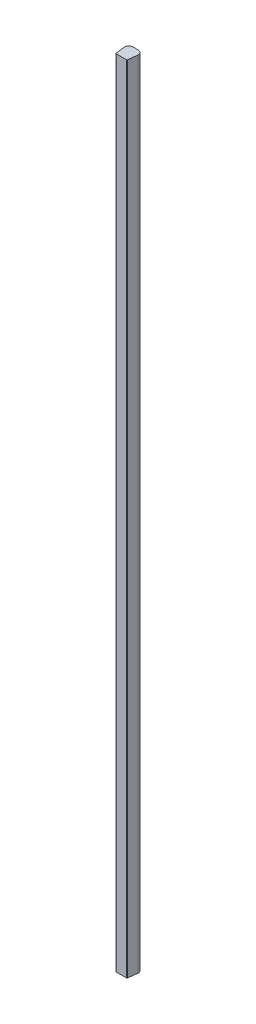
ISO-10303-21;
HEADER;
FILE_DESCRIPTION(('STEP AP214'),'2;1');
FILE_NAME('part.step','',(''),(''),'','','');
FILE_SCHEMA(('AUTOMOTIVE_DESIGN { 1 0 10303 214 1 1 1 1 }'));
ENDSEC;
DATA;
#1=APPLICATION_CONTEXT('core data for automotive mechanical design processes');
#2=APPLICATION_PROTOCOL_DEFINITION('international standard','automotive_design',2000,#1);
#3=PRODUCT_CONTEXT('',#1,'mechanical');
#4=PRODUCT('Part','Part','',(#3));
#5=PRODUCT_RELATED_PRODUCT_CATEGORY('part','',(#4));
#6=PRODUCT_DEFINITION_FORMATION('','',#4);
#7=PRODUCT_DEFINITION_CONTEXT('part definition',#1,'design');
#8=PRODUCT_DEFINITION('design','',#6,#7);
#9=PRODUCT_DEFINITION_SHAPE('','',#8);
#10=(LENGTH_UNIT() NAMED_UNIT(*) SI_UNIT(.MILLI.,.METRE.));
#11=(NAMED_UNIT(*) PLANE_ANGLE_UNIT() SI_UNIT($,.RADIAN.));
#12=(NAMED_UNIT(*) SI_UNIT($,.STERADIAN.) SOLID_ANGLE_UNIT());
#13=UNCERTAINTY_MEASURE_WITH_UNIT(LENGTH_MEASURE(1.E-05),#10,'distance_accuracy_value','');
#14=(GEOMETRIC_REPRESENTATION_CONTEXT(3) GLOBAL_UNCERTAINTY_ASSIGNED_CONTEXT((#13)) GLOBAL_UNIT_ASSIGNED_CONTEXT((#10,
#11,#12)) REPRESENTATION_CONTEXT('',''));
#15=CARTESIAN_POINT('',(0.,0.,0.));
#16=DIRECTION('',(0.,0.,1.));
#17=DIRECTION('',(1.,0.,0.));
#18=AXIS2_PLACEMENT_3D('',#15,#16,#17);
#19=CARTESIAN_POINT('',(12.657693959334,2133.6,2.96357615590343));
#20=DIRECTION('',(0.,-1.,0.));
#21=DIRECTION('',(0.,0.,-1.));
#22=AXIS2_PLACEMENT_3D('',#19,#20,#21);
#23=CYLINDRICAL_SURFACE('',#22,13.);
#24=CARTESIAN_POINT('',(12.657693959334,0.,2.96357615590343));
#25=DIRECTION('',(0.,1.,0.));
#26=DIRECTION('',(0.,0.,-1.));
#27=AXIS2_PLACEMENT_3D('',#24,#25,#26);
#28=CIRCLE('',#27,13.);
#29=CARTESIAN_POINT('',(13.6301615680965,0.,-10.));
#30=VERTEX_POINT('',#29);
#31=CARTESIAN_POINT('',(2.1101832656479,0.,-4.63576711615483));
#32=VERTEX_POINT('',#31);
#33=EDGE_CURVE('E152',#30,#32,#28,.T.);
#34=ORIENTED_EDGE('',*,*,#33,.T.);
#35=DIRECTION('',(0.,-1.,0.));
#36=VECTOR('',#35,1.);
#37=CARTESIAN_POINT('',(2.1101832656479,2133.6,-4.63576711615483));
#38=LINE('',#37,#36);
#39=CARTESIAN_POINT('',(2.1101832656479,2133.6,-4.63576711615483));
#40=VERTEX_POINT('',#39);
#41=EDGE_CURVE('E11',#40,#32,#38,.T.);
#42=ORIENTED_EDGE('',*,*,#41,.F.);
#43=CARTESIAN_POINT('',(12.657693959334,2133.6,2.96357615590343));
#44=DIRECTION('',(0.,1.,0.));
#45=DIRECTION('',(0.,0.,-1.));
#46=AXIS2_PLACEMENT_3D('',#43,#44,#45);
#47=CIRCLE('',#46,13.);
#48=CARTESIAN_POINT('',(13.6301615680965,2133.6,-10.));
#49=VERTEX_POINT('',#48);
#50=EDGE_CURVE('E180',#49,#40,#47,.T.);
#51=ORIENTED_EDGE('',*,*,#50,.F.);
#52=DIRECTION('',(0.,-1.,0.));
#53=VECTOR('',#52,1.);
#54=CARTESIAN_POINT('',(13.6301615680965,2133.6,-10.));
#55=LINE('',#54,#53);
#56=EDGE_CURVE('E148',#49,#30,#55,.T.);
#57=ORIENTED_EDGE('',*,*,#56,.T.);
#58=EDGE_LOOP('',(#34,#42,#51,#57));
#59=FACE_BOUND('',#58,.T.);
#60=ADVANCED_FACE('F39',(#59),#23,.T.);
#61=CARTESIAN_POINT('',(10.2236530300218,2133.6,1.20988155465921));
#62=DIRECTION('',(0.,-1.,0.));
#63=DIRECTION('',(0.,0.,-1.));
#64=AXIS2_PLACEMENT_3D('',#61,#62,#63);
#65=CYLINDRICAL_SURFACE('',#64,10.);
#66=CARTESIAN_POINT('',(10.2236530300218,0.,1.20988155465921));
#67=DIRECTION('',(0.,1.,0.));
#68=DIRECTION('',(0.,0.,-1.));
#69=AXIS2_PLACEMENT_3D('',#66,#67,#68);
#70=CIRCLE('',#69,10.);
#71=CARTESIAN_POINT('',(0.298191513608607,0.,2.42857498871066));
#72=VERTEX_POINT('',#71);
#73=EDGE_CURVE('E156',#32,#72,#70,.T.);
#74=ORIENTED_EDGE('',*,*,#73,.T.);
#75=DIRECTION('',(0.,-1.,0.));
#76=VECTOR('',#75,1.);
#77=CARTESIAN_POINT('',(0.298191513608607,2133.6,2.42857498871066));
#78=LINE('',#77,#76);
#79=CARTESIAN_POINT('',(0.298191513608607,2133.6,2.42857498871066));
#80=VERTEX_POINT('',#79);
#81=EDGE_CURVE('E48',#80,#72,#78,.T.);
#82=ORIENTED_EDGE('',*,*,#81,.F.);
#83=CARTESIAN_POINT('',(10.2236530300218,2133.6,1.20988155465921));
#84=DIRECTION('',(0.,1.,0.));
#85=DIRECTION('',(0.,0.,-1.));
#86=AXIS2_PLACEMENT_3D('',#83,#84,#85);
#87=CIRCLE('',#86,10.);
#88=EDGE_CURVE('E105',#40,#80,#87,.T.);
#89=ORIENTED_EDGE('',*,*,#88,.F.);
#90=ORIENTED_EDGE('',*,*,#41,.T.);
#91=EDGE_LOOP('',(#74,#82,#89,#90));
#92=FACE_BOUND('',#91,.T.);
#93=ADVANCED_FACE('F244',(#92),#65,.T.);
#94=CARTESIAN_POINT('',(0.298191513608607,2133.6,2.42857498871066));
#95=DIRECTION('',(0.992546151641322,0.,-0.121869343405144));
#96=DIRECTION('',(-0.121869343405144,0.,-0.992546151641323));
#97=AXIS2_PLACEMENT_3D('',#94,#95,#96);
#98=PLANE('',#97);
#99=DIRECTION('',(0.121869343405144,0.,0.992546151641322));
#100=VECTOR('',#99,1.);
#101=CARTESIAN_POINT('',(0.298191513608607,0.,2.42857498871066));
#102=LINE('',#101,#100);
#103=CARTESIAN_POINT('',(3.29922521014799,0.,26.8700330553532));
#104=VERTEX_POINT('',#103);
#105=EDGE_CURVE('E159',#72,#104,#102,.T.);
#106=ORIENTED_EDGE('',*,*,#105,.T.);
#107=DIRECTION('',(0.,-1.,0.));
#108=VECTOR('',#107,1.);
#109=CARTESIAN_POINT('',(3.29922521014799,2133.6,26.8700330553532));
#110=LINE('',#109,#108);
#111=CARTESIAN_POINT('',(3.29922521014799,2133.6,26.8700330553532));
#112=VERTEX_POINT('',#111);
#113=EDGE_CURVE('E199',#112,#104,#110,.T.);
#114=ORIENTED_EDGE('',*,*,#113,.F.);
#115=DIRECTION('',(0.121869343405144,0.,0.992546151641322));
#116=VECTOR('',#115,1.);
#117=CARTESIAN_POINT('',(0.298191513608607,2133.6,2.42857498871066));
#118=LINE('',#117,#116);
#119=EDGE_CURVE('E209',#80,#112,#118,.T.);
#120=ORIENTED_EDGE('',*,*,#119,.F.);
#121=ORIENTED_EDGE('',*,*,#81,.T.);
#122=EDGE_LOOP('',(#106,#114,#120,#121));
#123=FACE_BOUND('',#122,.T.);
#124=ADVANCED_FACE('F207',(#123),#98,.F.);
#125=CARTESIAN_POINT('',(5.28431751343064,2133.6,26.6262943685429));
#126=DIRECTION('',(0.,-1.,0.));
#127=DIRECTION('',(0.,0.,-1.));
#128=AXIS2_PLACEMENT_3D('',#125,#126,#127);
#129=CYLINDRICAL_SURFACE('',#128,2.);
#130=CARTESIAN_POINT('',(5.28431751343064,0.,26.6262943685429));
#131=DIRECTION('',(0.,1.,0.));
#132=DIRECTION('',(0.,0.,1.));
#133=AXIS2_PLACEMENT_3D('',#130,#131,#132);
#134=CIRCLE('',#133,2.);
#135=CARTESIAN_POINT('',(5.28431751343065,0.,28.6262943685429));
#136=VERTEX_POINT('',#135);
#137=EDGE_CURVE('E162',#104,#136,#134,.T.);
#138=ORIENTED_EDGE('',*,*,#137,.T.);
#139=DIRECTION('',(0.,-1.,0.));
#140=VECTOR('',#139,1.);
#141=CARTESIAN_POINT('',(5.28431751343065,2133.6,28.6262943685429));
#142=LINE('',#141,#140);
#143=CARTESIAN_POINT('',(5.28431751343065,2133.6,28.6262943685429));
#144=VERTEX_POINT('',#143);
#145=EDGE_CURVE('E195',#144,#136,#142,.T.);
#146=ORIENTED_EDGE('',*,*,#145,.F.);
#147=CARTESIAN_POINT('',(5.28431751343064,2133.6,26.6262943685429));
#148=DIRECTION('',(0.,1.,0.));
#149=DIRECTION('',(0.,0.,1.));
#150=AXIS2_PLACEMENT_3D('',#147,#148,#149);
#151=CIRCLE('',#150,2.);
#152=EDGE_CURVE('E228',#112,#144,#151,.T.);
#153=ORIENTED_EDGE('',*,*,#152,.F.);
#154=ORIENTED_EDGE('',*,*,#113,.T.);
#155=EDGE_LOOP('',(#138,#146,#153,#154));
#156=FACE_BOUND('',#155,.T.);
#157=ADVANCED_FACE('F218',(#156),#129,.T.);
#158=CARTESIAN_POINT('',(5.28431751343065,2133.6,28.6262943685429));
#159=DIRECTION('',(0.,0.,-1.));
#160=DIRECTION('',(-1.,0.,0.));
#161=AXIS2_PLACEMENT_3D('',#158,#159,#160);
#162=PLANE('',#161);
#163=DIRECTION('',(1.,0.,0.));
#164=VECTOR('',#163,1.);
#165=CARTESIAN_POINT('',(5.28431751343065,0.,28.6262943685429));
#166=LINE('',#165,#164);
#167=CARTESIAN_POINT('',(31.9760056227623,0.,28.626294368543));
#168=VERTEX_POINT('',#167);
#169=EDGE_CURVE('E165',#136,#168,#166,.T.);
#170=ORIENTED_EDGE('',*,*,#169,.T.);
#171=DIRECTION('',(0.,-1.,0.));
#172=VECTOR('',#171,1.);
#173=CARTESIAN_POINT('',(31.9760056227623,2133.6,28.626294368543));
#174=LINE('',#173,#172);
#175=CARTESIAN_POINT('',(31.9760056227623,2133.6,28.626294368543));
#176=VERTEX_POINT('',#175);
#177=EDGE_CURVE('E191',#176,#168,#174,.T.);
#178=ORIENTED_EDGE('',*,*,#177,.F.);
#179=DIRECTION('',(1.,0.,0.));
#180=VECTOR('',#179,1.);
#181=CARTESIAN_POINT('',(5.28431751343065,2133.6,28.6262943685429));
#182=LINE('',#181,#180);
#183=EDGE_CURVE('E224',#144,#176,#182,.T.);
#184=ORIENTED_EDGE('',*,*,#183,.F.);
#185=ORIENTED_EDGE('',*,*,#145,.T.);
#186=EDGE_LOOP('',(#170,#178,#184,#185));
#187=FACE_BOUND('',#186,.T.);
#188=ADVANCED_FACE('F222',(#187),#162,.F.);
#189=CARTESIAN_POINT('',(31.9760056227623,2133.6,26.6262943685429));
#190=DIRECTION('',(0.,-1.,0.));
#191=DIRECTION('',(0.,0.,-1.));
#192=AXIS2_PLACEMENT_3D('',#189,#190,#191);
#193=CYLINDRICAL_SURFACE('',#192,2.);
#194=CARTESIAN_POINT('',(31.9760056227623,0.,26.6262943685429));
#195=DIRECTION('',(0.,1.,0.));
#196=DIRECTION('',(0.,0.,1.));
#197=AXIS2_PLACEMENT_3D('',#194,#195,#196);
#198=CIRCLE('',#197,2.);
#199=CARTESIAN_POINT('',(33.961097926045,0.,26.8700330553532));
#200=VERTEX_POINT('',#199);
#201=EDGE_CURVE('E168',#168,#200,#198,.T.);
#202=ORIENTED_EDGE('',*,*,#201,.T.);
#203=DIRECTION('',(0.,-1.,0.));
#204=VECTOR('',#203,1.);
#205=CARTESIAN_POINT('',(33.961097926045,2133.6,26.8700330553532));
#206=LINE('',#205,#204);
#207=CARTESIAN_POINT('',(33.961097926045,2133.6,26.8700330553532));
#208=VERTEX_POINT('',#207);
#209=EDGE_CURVE('E187',#208,#200,#206,.T.);
#210=ORIENTED_EDGE('',*,*,#209,.F.);
#211=CARTESIAN_POINT('',(31.9760056227623,2133.6,26.6262943685429));
#212=DIRECTION('',(0.,1.,0.));
#213=DIRECTION('',(0.,0.,1.));
#214=AXIS2_PLACEMENT_3D('',#211,#212,#213);
#215=CIRCLE('',#214,2.);
#216=EDGE_CURVE('E227',#176,#208,#215,.T.);
#217=ORIENTED_EDGE('',*,*,#216,.F.);
#218=ORIENTED_EDGE('',*,*,#177,.T.);
#219=EDGE_LOOP('',(#202,#210,#217,#218));
#220=FACE_BOUND('',#219,.T.);
#221=ADVANCED_FACE('F256',(#220),#193,.T.);
#222=CARTESIAN_POINT('',(36.970576623517,2133.6,2.35979597553153));
#223=DIRECTION('',(-0.992546151641322,0.,-0.121869343405151));
#224=DIRECTION('',(-0.121869343405151,0.,0.992546151641322));
#225=AXIS2_PLACEMENT_3D('',#222,#223,#224);
#226=PLANE('',#225);
#227=DIRECTION('',(0.121869343405151,0.,-0.992546151641322));
#228=VECTOR('',#227,1.);
#229=CARTESIAN_POINT('',(36.970576623517,0.,2.35979597553153));
#230=LINE('',#229,#228);
#231=CARTESIAN_POINT('',(36.970576623517,0.,2.35979597553153));
#232=VERTEX_POINT('',#231);
#233=EDGE_CURVE('E171',#200,#232,#230,.T.);
#234=ORIENTED_EDGE('',*,*,#233,.T.);
#235=DIRECTION('',(0.,-1.,0.));
#236=VECTOR('',#235,1.);
#237=CARTESIAN_POINT('',(36.970576623517,2133.6,2.35979597553153));
#238=LINE('',#237,#236);
#239=CARTESIAN_POINT('',(36.970576623517,2133.6,2.35979597553153));
#240=VERTEX_POINT('',#239);
#241=EDGE_CURVE('E141',#240,#232,#238,.T.);
#242=ORIENTED_EDGE('',*,*,#241,.F.);
#243=DIRECTION('',(0.121869343405151,0.,-0.992546151641322));
#244=VECTOR('',#243,1.);
#245=CARTESIAN_POINT('',(36.970576623517,2133.6,2.35979597553153));
#246=LINE('',#245,#244);
#247=EDGE_CURVE('E130',#208,#240,#246,.T.);
#248=ORIENTED_EDGE('',*,*,#247,.F.);
#249=ORIENTED_EDGE('',*,*,#209,.T.);
#250=EDGE_LOOP('',(#234,#242,#248,#249));
#251=FACE_BOUND('',#250,.T.);
#252=ADVANCED_FACE('F259',(#251),#226,.F.);
#253=CARTESIAN_POINT('',(27.0451151071038,2133.6,1.14110254148002));
#254=DIRECTION('',(0.,-1.,0.));
#255=DIRECTION('',(0.,0.,-1.));
#256=AXIS2_PLACEMENT_3D('',#253,#254,#255);
#257=CYLINDRICAL_SURFACE('',#256,10.);
#258=CARTESIAN_POINT('',(27.0451151071038,0.,1.14110254148002));
#259=DIRECTION('',(0.,1.,0.));
#260=DIRECTION('',(0.,0.,1.));
#261=AXIS2_PLACEMENT_3D('',#258,#259,#260);
#262=CIRCLE('',#261,10.);
#263=CARTESIAN_POINT('',(34.9994172411373,0.,-4.91934938560512));
#264=VERTEX_POINT('',#263);
#265=EDGE_CURVE('E139',#232,#264,#262,.T.);
#266=ORIENTED_EDGE('',*,*,#265,.T.);
#267=DIRECTION('',(0.,-1.,0.));
#268=VECTOR('',#267,1.);
#269=CARTESIAN_POINT('',(34.9994172411373,2133.6,-4.91934938560512));
#270=LINE('',#269,#268);
#271=CARTESIAN_POINT('',(34.9994172411373,2133.6,-4.91934938560512));
#272=VERTEX_POINT('',#271);
#273=EDGE_CURVE('E136',#272,#264,#270,.T.);
#274=ORIENTED_EDGE('',*,*,#273,.F.);
#275=CARTESIAN_POINT('',(27.0451151071038,2133.6,1.14110254148002));
#276=DIRECTION('',(0.,1.,0.));
#277=DIRECTION('',(0.,0.,1.));
#278=AXIS2_PLACEMENT_3D('',#275,#276,#277);
#279=CIRCLE('',#278,10.);
#280=EDGE_CURVE('E124',#240,#272,#279,.T.);
#281=ORIENTED_EDGE('',*,*,#280,.F.);
#282=ORIENTED_EDGE('',*,*,#241,.T.);
#283=EDGE_LOOP('',(#266,#274,#281,#282));
#284=FACE_BOUND('',#283,.T.);
#285=ADVANCED_FACE('F137',(#284),#257,.T.);
#286=CARTESIAN_POINT('',(24.6588244668938,2133.6,2.95923811960556));
#287=DIRECTION('',(0.,-1.,0.));
#288=DIRECTION('',(0.,0.,-1.));
#289=AXIS2_PLACEMENT_3D('',#286,#287,#288);
#290=CYLINDRICAL_SURFACE('',#289,13.);
#291=CARTESIAN_POINT('',(24.6588244668938,0.,2.95923811960556));
#292=DIRECTION('',(0.,1.,0.));
#293=DIRECTION('',(0.,0.,1.));
#294=AXIS2_PLACEMENT_3D('',#291,#292,#293);
#295=CIRCLE('',#294,13.);
#296=CARTESIAN_POINT('',(23.6301615680965,0.,-10.));
#297=VERTEX_POINT('',#296);
#298=EDGE_CURVE('E91',#264,#297,#295,.T.);
#299=ORIENTED_EDGE('',*,*,#298,.T.);
#300=DIRECTION('',(0.,-1.,0.));
#301=VECTOR('',#300,1.);
#302=CARTESIAN_POINT('',(23.6301615680965,2133.6,-10.));
#303=LINE('',#302,#301);
#304=CARTESIAN_POINT('',(23.6301615680965,2133.6,-10.));
#305=VERTEX_POINT('',#304);
#306=EDGE_CURVE('E142',#305,#297,#303,.T.);
#307=ORIENTED_EDGE('',*,*,#306,.F.);
#308=CARTESIAN_POINT('',(24.6588244668938,2133.6,2.95923811960556));
#309=DIRECTION('',(0.,1.,0.));
#310=DIRECTION('',(0.,0.,1.));
#311=AXIS2_PLACEMENT_3D('',#308,#309,#310);
#312=CIRCLE('',#311,13.);
#313=EDGE_CURVE('E128',#272,#305,#312,.T.);
#314=ORIENTED_EDGE('',*,*,#313,.F.);
#315=ORIENTED_EDGE('',*,*,#273,.T.);
#316=EDGE_LOOP('',(#299,#307,#314,#315));
#317=FACE_BOUND('',#316,.T.);
#318=ADVANCED_FACE('F144',(#317),#290,.T.);
#319=CARTESIAN_POINT('',(13.6301615680965,2133.6,-10.));
#320=DIRECTION('',(0.,0.,1.));
#321=DIRECTION('',(1.,0.,0.));
#322=AXIS2_PLACEMENT_3D('',#319,#320,#321);
#323=PLANE('',#322);
#324=DIRECTION('',(-1.,0.,0.));
#325=VECTOR('',#324,1.);
#326=CARTESIAN_POINT('',(13.6301615680965,0.,-10.));
#327=LINE('',#326,#325);
#328=EDGE_CURVE('E97',#297,#30,#327,.T.);
#329=ORIENTED_EDGE('',*,*,#328,.T.);
#330=ORIENTED_EDGE('',*,*,#56,.F.);
#331=DIRECTION('',(-1.,0.,0.));
#332=VECTOR('',#331,1.);
#333=CARTESIAN_POINT('',(13.6301615680965,2133.6,-10.));
#334=LINE('',#333,#332);
#335=EDGE_CURVE('E56',#305,#49,#334,.T.);
#336=ORIENTED_EDGE('',*,*,#335,.F.);
#337=ORIENTED_EDGE('',*,*,#306,.T.);
#338=EDGE_LOOP('',(#329,#330,#336,#337));
#339=FACE_BOUND('',#338,.T.);
#340=ADVANCED_FACE('F268',(#339),#323,.F.);
#341=CARTESIAN_POINT('',(12.657693959334,2133.6,2.96357615590343));
#342=DIRECTION('',(0.,-1.,0.));
#343=DIRECTION('',(0.,0.,-1.));
#344=AXIS2_PLACEMENT_3D('',#341,#342,#343);
#345=PLANE('',#344);
#346=ORIENTED_EDGE('',*,*,#50,.T.);
#347=ORIENTED_EDGE('',*,*,#88,.T.);
#348=ORIENTED_EDGE('',*,*,#119,.T.);
#349=ORIENTED_EDGE('',*,*,#152,.T.);
#350=ORIENTED_EDGE('',*,*,#183,.T.);
#351=ORIENTED_EDGE('',*,*,#216,.T.);
#352=ORIENTED_EDGE('',*,*,#247,.T.);
#353=ORIENTED_EDGE('',*,*,#280,.T.);
#354=ORIENTED_EDGE('',*,*,#313,.T.);
#355=ORIENTED_EDGE('',*,*,#335,.T.);
#356=EDGE_LOOP('',(#346,#347,#348,#349,#350,#351,#352,#353,#354,#355));
#357=FACE_BOUND('',#356,.T.);
#358=ADVANCED_FACE('F126',(#357),#345,.F.);
#359=CARTESIAN_POINT('',(12.657693959334,0.,2.96357615590343));
#360=DIRECTION('',(0.,-1.,0.));
#361=DIRECTION('',(0.,0.,-1.));
#362=AXIS2_PLACEMENT_3D('',#359,#360,#361);
#363=PLANE('',#362);
#364=ORIENTED_EDGE('',*,*,#33,.F.);
#365=ORIENTED_EDGE('',*,*,#328,.F.);
#366=ORIENTED_EDGE('',*,*,#298,.F.);
#367=ORIENTED_EDGE('',*,*,#265,.F.);
#368=ORIENTED_EDGE('',*,*,#233,.F.);
#369=ORIENTED_EDGE('',*,*,#201,.F.);
#370=ORIENTED_EDGE('',*,*,#169,.F.);
#371=ORIENTED_EDGE('',*,*,#137,.F.);
#372=ORIENTED_EDGE('',*,*,#105,.F.);
#373=ORIENTED_EDGE('',*,*,#73,.F.);
#374=EDGE_LOOP('',(#364,#365,#366,#367,#368,#369,#370,#371,#372,#373));
#375=FACE_BOUND('',#374,.T.);
#376=ADVANCED_FACE('F213',(#375),#363,.T.);
#377=CLOSED_SHELL('',(#60,#93,#124,#157,#188,#221,#252,#285,#318,#340,#358,#376));
#378=MANIFOLD_SOLID_BREP('B2',#377);
#379=ADVANCED_BREP_SHAPE_REPRESENTATION('',(#18,#378),#14);
#380=SHAPE_DEFINITION_REPRESENTATION(#9,#379);
ENDSEC;
END-ISO-10303-21;
